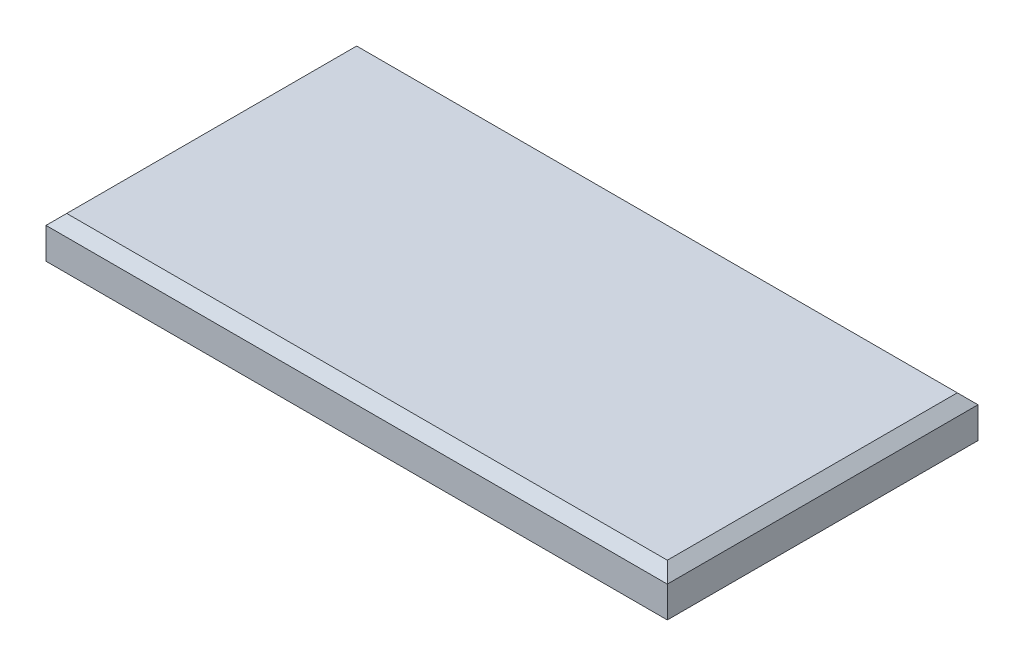
ISO-10303-21;
HEADER;
FILE_DESCRIPTION(('STEP AP214'),'2;1');
FILE_NAME('part.step','',(''),(''),'','','');
FILE_SCHEMA(('AUTOMOTIVE_DESIGN { 1 0 10303 214 1 1 1 1 }'));
ENDSEC;
DATA;
#1=APPLICATION_CONTEXT('core data for automotive mechanical design processes');
#2=APPLICATION_PROTOCOL_DEFINITION('international standard','automotive_design',2000,#1);
#3=PRODUCT_CONTEXT('',#1,'mechanical');
#4=PRODUCT('Part','Part','',(#3));
#5=PRODUCT_RELATED_PRODUCT_CATEGORY('part','',(#4));
#6=PRODUCT_DEFINITION_FORMATION('','',#4);
#7=PRODUCT_DEFINITION_CONTEXT('part definition',#1,'design');
#8=PRODUCT_DEFINITION('design','',#6,#7);
#9=PRODUCT_DEFINITION_SHAPE('','',#8);
#10=(LENGTH_UNIT() NAMED_UNIT(*) SI_UNIT(.MILLI.,.METRE.));
#11=(NAMED_UNIT(*) PLANE_ANGLE_UNIT() SI_UNIT($,.RADIAN.));
#12=(NAMED_UNIT(*) SI_UNIT($,.STERADIAN.) SOLID_ANGLE_UNIT());
#13=UNCERTAINTY_MEASURE_WITH_UNIT(LENGTH_MEASURE(1.E-05),#10,'distance_accuracy_value','');
#14=(GEOMETRIC_REPRESENTATION_CONTEXT(3) GLOBAL_UNCERTAINTY_ASSIGNED_CONTEXT((#13)) GLOBAL_UNIT_ASSIGNED_CONTEXT((#10,
#11,#12)) REPRESENTATION_CONTEXT('',''));
#15=CARTESIAN_POINT('',(0.,0.,0.));
#16=DIRECTION('',(0.,0.,1.));
#17=DIRECTION('',(1.,0.,0.));
#18=AXIS2_PLACEMENT_3D('',#15,#16,#17);
#19=CARTESIAN_POINT('',(0.,0.,0.));
#20=DIRECTION('',(0.,-1.,0.));
#21=DIRECTION('',(0.,0.,-1.));
#22=AXIS2_PLACEMENT_3D('',#19,#20,#21);
#23=PLANE('',#22);
#24=DIRECTION('',(0.,0.,-1.));
#25=VECTOR('',#24,1.);
#26=CARTESIAN_POINT('',(30.,0.,15.));
#27=LINE('',#26,#25);
#28=CARTESIAN_POINT('',(30.,0.,15.));
#29=VERTEX_POINT('',#28);
#30=CARTESIAN_POINT('',(30.,0.,-15.));
#31=VERTEX_POINT('',#30);
#32=EDGE_CURVE('E148',#29,#31,#27,.T.);
#33=ORIENTED_EDGE('',*,*,#32,.F.);
#34=DIRECTION('',(1.,0.,0.));
#35=VECTOR('',#34,1.);
#36=CARTESIAN_POINT('',(-30.,0.,15.));
#37=LINE('',#36,#35);
#38=CARTESIAN_POINT('',(-30.,0.,15.));
#39=VERTEX_POINT('',#38);
#40=EDGE_CURVE('E190',#39,#29,#37,.T.);
#41=ORIENTED_EDGE('',*,*,#40,.F.);
#42=DIRECTION('',(0.,0.,1.));
#43=VECTOR('',#42,1.);
#44=CARTESIAN_POINT('',(-30.,0.,15.));
#45=LINE('',#44,#43);
#46=CARTESIAN_POINT('',(-30.,0.,-15.));
#47=VERTEX_POINT('',#46);
#48=EDGE_CURVE('E186',#47,#39,#45,.T.);
#49=ORIENTED_EDGE('',*,*,#48,.F.);
#50=DIRECTION('',(-1.,0.,0.));
#51=VECTOR('',#50,1.);
#52=CARTESIAN_POINT('',(-30.,0.,-15.));
#53=LINE('',#52,#51);
#54=EDGE_CURVE('E154',#31,#47,#53,.T.);
#55=ORIENTED_EDGE('',*,*,#54,.F.);
#56=EDGE_LOOP('',(#33,#41,#49,#55));
#57=FACE_BOUND('',#56,.T.);
#58=DIRECTION('',(1.,0.,0.));
#59=VECTOR('',#58,1.);
#60=CARTESIAN_POINT('',(0.,0.,13.));
#61=LINE('',#60,#59);
#62=CARTESIAN_POINT('',(-28.,0.,13.));
#63=VERTEX_POINT('',#62);
#64=CARTESIAN_POINT('',(28.,0.,13.));
#65=VERTEX_POINT('',#64);
#66=EDGE_CURVE('E142',#63,#65,#61,.T.);
#67=ORIENTED_EDGE('',*,*,#66,.T.);
#68=DIRECTION('',(0.,0.,-1.));
#69=VECTOR('',#68,1.);
#70=CARTESIAN_POINT('',(28.,0.,0.));
#71=LINE('',#70,#69);
#72=CARTESIAN_POINT('',(28.,0.,-13.));
#73=VERTEX_POINT('',#72);
#74=EDGE_CURVE('E171',#65,#73,#71,.T.);
#75=ORIENTED_EDGE('',*,*,#74,.T.);
#76=DIRECTION('',(-1.,0.,0.));
#77=VECTOR('',#76,1.);
#78=CARTESIAN_POINT('',(0.,0.,-13.));
#79=LINE('',#78,#77);
#80=CARTESIAN_POINT('',(-28.,0.,-13.));
#81=VERTEX_POINT('',#80);
#82=EDGE_CURVE('E146',#73,#81,#79,.T.);
#83=ORIENTED_EDGE('',*,*,#82,.T.);
#84=DIRECTION('',(0.,0.,1.));
#85=VECTOR('',#84,1.);
#86=CARTESIAN_POINT('',(-28.,0.,0.));
#87=LINE('',#86,#85);
#88=EDGE_CURVE('E177',#81,#63,#87,.T.);
#89=ORIENTED_EDGE('',*,*,#88,.T.);
#90=EDGE_LOOP('',(#67,#75,#83,#89));
#91=FACE_BOUND('',#90,.T.);
#92=ADVANCED_FACE('F41',(#57,#91),#23,.T.);
#93=CARTESIAN_POINT('',(30.,4.,15.));
#94=DIRECTION('',(-1.,0.,0.));
#95=DIRECTION('',(0.,0.,1.));
#96=AXIS2_PLACEMENT_3D('',#93,#94,#95);
#97=PLANE('',#96);
#98=DIRECTION('',(0.,-1.,0.));
#99=VECTOR('',#98,1.);
#100=CARTESIAN_POINT('',(30.,4.,-15.));
#101=LINE('',#100,#99);
#102=CARTESIAN_POINT('',(30.,2.99999999999999,-15.));
#103=VERTEX_POINT('',#102);
#104=EDGE_CURVE('E203',#103,#31,#101,.T.);
#105=ORIENTED_EDGE('',*,*,#104,.F.);
#106=DIRECTION('',(0.,0.,1.));
#107=VECTOR('',#106,1.);
#108=CARTESIAN_POINT('',(30.,2.99999999999999,15.));
#109=LINE('',#108,#107);
#110=CARTESIAN_POINT('',(30.,2.99999999999999,15.));
#111=VERTEX_POINT('',#110);
#112=EDGE_CURVE('E11',#103,#111,#109,.T.);
#113=ORIENTED_EDGE('',*,*,#112,.T.);
#114=DIRECTION('',(0.,-1.,0.));
#115=VECTOR('',#114,1.);
#116=CARTESIAN_POINT('',(30.,4.,15.));
#117=LINE('',#116,#115);
#118=EDGE_CURVE('E194',#111,#29,#117,.T.);
#119=ORIENTED_EDGE('',*,*,#118,.T.);
#120=ORIENTED_EDGE('',*,*,#32,.T.);
#121=EDGE_LOOP('',(#105,#113,#119,#120));
#122=FACE_BOUND('',#121,.T.);
#123=ADVANCED_FACE('F287',(#122),#97,.F.);
#124=CARTESIAN_POINT('',(-30.,4.,-15.));
#125=DIRECTION('',(0.,0.,1.));
#126=DIRECTION('',(1.,0.,0.));
#127=AXIS2_PLACEMENT_3D('',#124,#125,#126);
#128=PLANE('',#127);
#129=DIRECTION('',(0.,-1.,0.));
#130=VECTOR('',#129,1.);
#131=CARTESIAN_POINT('',(-30.,4.,-15.));
#132=LINE('',#131,#130);
#133=CARTESIAN_POINT('',(-30.,2.99999999999999,-15.));
#134=VERTEX_POINT('',#133);
#135=EDGE_CURVE('E200',#134,#47,#132,.T.);
#136=ORIENTED_EDGE('',*,*,#135,.F.);
#137=DIRECTION('',(1.,0.,0.));
#138=VECTOR('',#137,1.);
#139=CARTESIAN_POINT('',(-30.,2.99999999999999,-15.));
#140=LINE('',#139,#138);
#141=EDGE_CURVE('E52',#134,#103,#140,.T.);
#142=ORIENTED_EDGE('',*,*,#141,.T.);
#143=ORIENTED_EDGE('',*,*,#104,.T.);
#144=ORIENTED_EDGE('',*,*,#54,.T.);
#145=EDGE_LOOP('',(#136,#142,#143,#144));
#146=FACE_BOUND('',#145,.T.);
#147=ADVANCED_FACE('F293',(#146),#128,.F.);
#148=CARTESIAN_POINT('',(-30.,4.,15.));
#149=DIRECTION('',(1.,0.,0.));
#150=DIRECTION('',(0.,0.,-1.));
#151=AXIS2_PLACEMENT_3D('',#148,#149,#150);
#152=PLANE('',#151);
#153=DIRECTION('',(0.,-1.,0.));
#154=VECTOR('',#153,1.);
#155=CARTESIAN_POINT('',(-30.,4.,15.));
#156=LINE('',#155,#154);
#157=CARTESIAN_POINT('',(-30.,2.99999999999999,15.));
#158=VERTEX_POINT('',#157);
#159=EDGE_CURVE('E197',#158,#39,#156,.T.);
#160=ORIENTED_EDGE('',*,*,#159,.F.);
#161=DIRECTION('',(0.,0.,-1.));
#162=VECTOR('',#161,1.);
#163=CARTESIAN_POINT('',(-30.,2.99999999999999,15.));
#164=LINE('',#163,#162);
#165=EDGE_CURVE('E67',#158,#134,#164,.T.);
#166=ORIENTED_EDGE('',*,*,#165,.T.);
#167=ORIENTED_EDGE('',*,*,#135,.T.);
#168=ORIENTED_EDGE('',*,*,#48,.T.);
#169=EDGE_LOOP('',(#160,#166,#167,#168));
#170=FACE_BOUND('',#169,.T.);
#171=ADVANCED_FACE('F303',(#170),#152,.F.);
#172=CARTESIAN_POINT('',(-30.,4.,15.));
#173=DIRECTION('',(0.,0.,-1.));
#174=DIRECTION('',(-1.,0.,0.));
#175=AXIS2_PLACEMENT_3D('',#172,#173,#174);
#176=PLANE('',#175);
#177=ORIENTED_EDGE('',*,*,#118,.F.);
#178=DIRECTION('',(-1.,0.,0.));
#179=VECTOR('',#178,1.);
#180=CARTESIAN_POINT('',(-30.,2.99999999999999,15.));
#181=LINE('',#180,#179);
#182=EDGE_CURVE('E235',#111,#158,#181,.T.);
#183=ORIENTED_EDGE('',*,*,#182,.T.);
#184=ORIENTED_EDGE('',*,*,#159,.T.);
#185=ORIENTED_EDGE('',*,*,#40,.T.);
#186=EDGE_LOOP('',(#177,#183,#184,#185));
#187=FACE_BOUND('',#186,.T.);
#188=ADVANCED_FACE('F300',(#187),#176,.F.);
#189=CARTESIAN_POINT('',(0.,4.,0.));
#190=DIRECTION('',(0.,-1.,0.));
#191=DIRECTION('',(0.,0.,-1.));
#192=AXIS2_PLACEMENT_3D('',#189,#190,#191);
#193=PLANE('',#192);
#194=DIRECTION('',(0.,0.,1.));
#195=VECTOR('',#194,1.);
#196=CARTESIAN_POINT('',(-29.,4.,0.));
#197=LINE('',#196,#195);
#198=CARTESIAN_POINT('',(-29.,4.,-14.));
#199=VERTEX_POINT('',#198);
#200=CARTESIAN_POINT('',(-29.,4.,14.));
#201=VERTEX_POINT('',#200);
#202=EDGE_CURVE('E228',#199,#201,#197,.T.);
#203=ORIENTED_EDGE('',*,*,#202,.T.);
#204=DIRECTION('',(1.,0.,0.));
#205=VECTOR('',#204,1.);
#206=CARTESIAN_POINT('',(0.,4.,14.));
#207=LINE('',#206,#205);
#208=CARTESIAN_POINT('',(29.,4.,14.));
#209=VERTEX_POINT('',#208);
#210=EDGE_CURVE('E231',#201,#209,#207,.T.);
#211=ORIENTED_EDGE('',*,*,#210,.T.);
#212=DIRECTION('',(0.,0.,-1.));
#213=VECTOR('',#212,1.);
#214=CARTESIAN_POINT('',(29.,4.,0.));
#215=LINE('',#214,#213);
#216=CARTESIAN_POINT('',(29.,4.,-14.));
#217=VERTEX_POINT('',#216);
#218=EDGE_CURVE('E222',#209,#217,#215,.T.);
#219=ORIENTED_EDGE('',*,*,#218,.T.);
#220=DIRECTION('',(-1.,0.,0.));
#221=VECTOR('',#220,1.);
#222=CARTESIAN_POINT('',(0.,4.,-14.));
#223=LINE('',#222,#221);
#224=EDGE_CURVE('E225',#217,#199,#223,.T.);
#225=ORIENTED_EDGE('',*,*,#224,.T.);
#226=EDGE_LOOP('',(#203,#211,#219,#225));
#227=FACE_BOUND('',#226,.T.);
#228=ADVANCED_FACE('F299',(#227),#193,.F.);
#229=CARTESIAN_POINT('',(28.,4.,15.));
#230=DIRECTION('',(-1.,0.,0.));
#231=DIRECTION('',(0.,0.,1.));
#232=AXIS2_PLACEMENT_3D('',#229,#230,#231);
#233=PLANE('',#232);
#234=ORIENTED_EDGE('',*,*,#74,.F.);
#235=DIRECTION('',(0.,-1.,0.));
#236=VECTOR('',#235,1.);
#237=CARTESIAN_POINT('',(28.,4.,13.));
#238=LINE('',#237,#236);
#239=CARTESIAN_POINT('',(28.,2.,13.));
#240=VERTEX_POINT('',#239);
#241=EDGE_CURVE('E140',#240,#65,#238,.T.);
#242=ORIENTED_EDGE('',*,*,#241,.F.);
#243=DIRECTION('',(0.,0.,-1.));
#244=VECTOR('',#243,1.);
#245=CARTESIAN_POINT('',(28.,2.,0.));
#246=LINE('',#245,#244);
#247=CARTESIAN_POINT('',(28.,2.,-13.));
#248=VERTEX_POINT('',#247);
#249=EDGE_CURVE('E125',#240,#248,#246,.T.);
#250=ORIENTED_EDGE('',*,*,#249,.T.);
#251=DIRECTION('',(0.,-1.,0.));
#252=VECTOR('',#251,1.);
#253=CARTESIAN_POINT('',(28.,4.,-13.));
#254=LINE('',#253,#252);
#255=EDGE_CURVE('E138',#248,#73,#254,.T.);
#256=ORIENTED_EDGE('',*,*,#255,.T.);
#257=EDGE_LOOP('',(#234,#242,#250,#256));
#258=FACE_BOUND('',#257,.T.);
#259=ADVANCED_FACE('F137',(#258),#233,.T.);
#260=CARTESIAN_POINT('',(-30.,4.,-13.));
#261=DIRECTION('',(0.,0.,1.));
#262=DIRECTION('',(1.,0.,0.));
#263=AXIS2_PLACEMENT_3D('',#260,#261,#262);
#264=PLANE('',#263);
#265=ORIENTED_EDGE('',*,*,#82,.F.);
#266=ORIENTED_EDGE('',*,*,#255,.F.);
#267=DIRECTION('',(-1.,0.,0.));
#268=VECTOR('',#267,1.);
#269=CARTESIAN_POINT('',(0.,2.,-13.));
#270=LINE('',#269,#268);
#271=CARTESIAN_POINT('',(-28.,2.,-13.));
#272=VERTEX_POINT('',#271);
#273=EDGE_CURVE('E121',#248,#272,#270,.T.);
#274=ORIENTED_EDGE('',*,*,#273,.T.);
#275=DIRECTION('',(0.,-1.,0.));
#276=VECTOR('',#275,1.);
#277=CARTESIAN_POINT('',(-28.,4.,-13.));
#278=LINE('',#277,#276);
#279=EDGE_CURVE('E149',#272,#81,#278,.T.);
#280=ORIENTED_EDGE('',*,*,#279,.T.);
#281=EDGE_LOOP('',(#265,#266,#274,#280));
#282=FACE_BOUND('',#281,.T.);
#283=ADVANCED_FACE('F144',(#282),#264,.T.);
#284=CARTESIAN_POINT('',(-28.,4.,15.));
#285=DIRECTION('',(1.,0.,0.));
#286=DIRECTION('',(0.,0.,-1.));
#287=AXIS2_PLACEMENT_3D('',#284,#285,#286);
#288=PLANE('',#287);
#289=ORIENTED_EDGE('',*,*,#88,.F.);
#290=ORIENTED_EDGE('',*,*,#279,.F.);
#291=DIRECTION('',(0.,0.,1.));
#292=VECTOR('',#291,1.);
#293=CARTESIAN_POINT('',(-28.,2.,0.));
#294=LINE('',#293,#292);
#295=CARTESIAN_POINT('',(-28.,2.,13.));
#296=VERTEX_POINT('',#295);
#297=EDGE_CURVE('E126',#272,#296,#294,.T.);
#298=ORIENTED_EDGE('',*,*,#297,.T.);
#299=DIRECTION('',(0.,-1.,0.));
#300=VECTOR('',#299,1.);
#301=CARTESIAN_POINT('',(-28.,4.,13.));
#302=LINE('',#301,#300);
#303=EDGE_CURVE('E156',#296,#63,#302,.T.);
#304=ORIENTED_EDGE('',*,*,#303,.T.);
#305=EDGE_LOOP('',(#289,#290,#298,#304));
#306=FACE_BOUND('',#305,.T.);
#307=ADVANCED_FACE('F282',(#306),#288,.T.);
#308=CARTESIAN_POINT('',(-30.,4.,13.));
#309=DIRECTION('',(0.,0.,-1.));
#310=DIRECTION('',(-1.,0.,0.));
#311=AXIS2_PLACEMENT_3D('',#308,#309,#310);
#312=PLANE('',#311);
#313=ORIENTED_EDGE('',*,*,#66,.F.);
#314=ORIENTED_EDGE('',*,*,#303,.F.);
#315=DIRECTION('',(1.,0.,0.));
#316=VECTOR('',#315,1.);
#317=CARTESIAN_POINT('',(0.,2.,13.));
#318=LINE('',#317,#316);
#319=EDGE_CURVE('E163',#296,#240,#318,.T.);
#320=ORIENTED_EDGE('',*,*,#319,.T.);
#321=ORIENTED_EDGE('',*,*,#241,.T.);
#322=EDGE_LOOP('',(#313,#314,#320,#321));
#323=FACE_BOUND('',#322,.T.);
#324=ADVANCED_FACE('F272',(#323),#312,.T.);
#325=CARTESIAN_POINT('',(0.,2.,0.));
#326=DIRECTION('',(0.,-1.,0.));
#327=DIRECTION('',(0.,0.,-1.));
#328=AXIS2_PLACEMENT_3D('',#325,#326,#327);
#329=PLANE('',#328);
#330=CARTESIAN_POINT('',(15.,2.,0.));
#331=DIRECTION('',(0.,-1.,0.));
#332=DIRECTION('',(0.,0.,1.));
#333=AXIS2_PLACEMENT_3D('',#330,#331,#332);
#334=CIRCLE('',#333,2.);
#335=CARTESIAN_POINT('',(15.,2.,2.));
#336=VERTEX_POINT('',#335);
#337=EDGE_CURVE('E257',#336,#336,#334,.T.);
#338=ORIENTED_EDGE('',*,*,#337,.F.);
#339=EDGE_LOOP('',(#338));
#340=FACE_BOUND('',#339,.T.);
#341=CARTESIAN_POINT('',(-15.,2.,0.));
#342=DIRECTION('',(0.,-1.,0.));
#343=DIRECTION('',(0.,0.,-1.));
#344=AXIS2_PLACEMENT_3D('',#341,#342,#343);
#345=CIRCLE('',#344,2.);
#346=CARTESIAN_POINT('',(-15.,2.,-2.));
#347=VERTEX_POINT('',#346);
#348=EDGE_CURVE('E159',#347,#347,#345,.T.);
#349=ORIENTED_EDGE('',*,*,#348,.F.);
#350=EDGE_LOOP('',(#349));
#351=FACE_BOUND('',#350,.T.);
#352=ORIENTED_EDGE('',*,*,#249,.F.);
#353=ORIENTED_EDGE('',*,*,#319,.F.);
#354=ORIENTED_EDGE('',*,*,#297,.F.);
#355=ORIENTED_EDGE('',*,*,#273,.F.);
#356=EDGE_LOOP('',(#352,#353,#354,#355));
#357=FACE_BOUND('',#356,.T.);
#358=ADVANCED_FACE('F123',(#340,#351,#357),#329,.T.);
#359=CARTESIAN_POINT('',(-15.,-8.,0.));
#360=DIRECTION('',(0.,1.,0.));
#361=DIRECTION('',(0.,0.,1.));
#362=AXIS2_PLACEMENT_3D('',#359,#360,#361);
#363=CYLINDRICAL_SURFACE('',#362,2.);
#364=CARTESIAN_POINT('',(-15.,-7.,0.));
#365=DIRECTION('',(0.,-1.,0.));
#366=DIRECTION('',(0.,0.,-1.));
#367=AXIS2_PLACEMENT_3D('',#364,#365,#366);
#368=CIRCLE('',#367,2.);
#369=CARTESIAN_POINT('',(-15.,-7.,-2.));
#370=VERTEX_POINT('',#369);
#371=EDGE_CURVE('E218',#370,#370,#368,.F.);
#372=ORIENTED_EDGE('',*,*,#371,.T.);
#373=EDGE_LOOP('',(#372));
#374=FACE_BOUND('',#373,.T.);
#375=ORIENTED_EDGE('',*,*,#348,.T.);
#376=EDGE_LOOP('',(#375));
#377=FACE_BOUND('',#376,.T.);
#378=ADVANCED_FACE('F269',(#374,#377),#363,.T.);
#379=CARTESIAN_POINT('',(-15.,-8.,0.));
#380=DIRECTION('',(0.,-1.,0.));
#381=DIRECTION('',(0.,0.,-1.));
#382=AXIS2_PLACEMENT_3D('',#379,#380,#381);
#383=PLANE('',#382);
#384=CARTESIAN_POINT('',(-15.,-8.,0.));
#385=DIRECTION('',(0.,-1.,0.));
#386=DIRECTION('',(0.,0.,-1.));
#387=AXIS2_PLACEMENT_3D('',#384,#385,#386);
#388=CIRCLE('',#387,1.);
#389=CARTESIAN_POINT('',(-15.,-8.,-1.));
#390=VERTEX_POINT('',#389);
#391=EDGE_CURVE('E214',#390,#390,#388,.T.);
#392=ORIENTED_EDGE('',*,*,#391,.T.);
#393=EDGE_LOOP('',(#392));
#394=FACE_BOUND('',#393,.T.);
#395=ADVANCED_FACE('F279',(#394),#383,.T.);
#396=CARTESIAN_POINT('',(15.,-8.,0.));
#397=DIRECTION('',(0.,1.,0.));
#398=DIRECTION('',(0.,0.,1.));
#399=AXIS2_PLACEMENT_3D('',#396,#397,#398);
#400=CYLINDRICAL_SURFACE('',#399,2.);
#401=CARTESIAN_POINT('',(15.,-7.,0.));
#402=DIRECTION('',(0.,1.,0.));
#403=DIRECTION('',(0.,0.,1.));
#404=AXIS2_PLACEMENT_3D('',#401,#402,#403);
#405=CIRCLE('',#404,2.);
#406=CARTESIAN_POINT('',(15.,-7.,2.));
#407=VERTEX_POINT('',#406);
#408=EDGE_CURVE('E210',#407,#407,#405,.T.);
#409=ORIENTED_EDGE('',*,*,#408,.T.);
#410=EDGE_LOOP('',(#409));
#411=FACE_BOUND('',#410,.T.);
#412=ORIENTED_EDGE('',*,*,#337,.T.);
#413=EDGE_LOOP('',(#412));
#414=FACE_BOUND('',#413,.T.);
#415=ADVANCED_FACE('F391',(#411,#414),#400,.T.);
#416=CARTESIAN_POINT('',(15.,-8.,0.));
#417=DIRECTION('',(0.,1.,0.));
#418=DIRECTION('',(0.,0.,1.));
#419=AXIS2_PLACEMENT_3D('',#416,#417,#418);
#420=PLANE('',#419);
#421=CARTESIAN_POINT('',(15.,-8.,0.));
#422=DIRECTION('',(0.,1.,0.));
#423=DIRECTION('',(0.,0.,1.));
#424=AXIS2_PLACEMENT_3D('',#421,#422,#423);
#425=CIRCLE('',#424,1.);
#426=CARTESIAN_POINT('',(15.,-8.,1.));
#427=VERTEX_POINT('',#426);
#428=EDGE_CURVE('E206',#427,#427,#425,.F.);
#429=ORIENTED_EDGE('',*,*,#428,.T.);
#430=EDGE_LOOP('',(#429));
#431=FACE_BOUND('',#430,.T.);
#432=ADVANCED_FACE('F313',(#431),#420,.F.);
#433=CARTESIAN_POINT('',(15.,-7.,0.));
#434=DIRECTION('',(0.,1.,0.));
#435=DIRECTION('',(0.,0.,1.));
#436=AXIS2_PLACEMENT_3D('',#433,#434,#435);
#437=TOROIDAL_SURFACE('',#436,1.,1.);
#438=ORIENTED_EDGE('',*,*,#408,.F.);
#439=EDGE_LOOP('',(#438));
#440=FACE_BOUND('',#439,.T.);
#441=ORIENTED_EDGE('',*,*,#428,.F.);
#442=EDGE_LOOP('',(#441));
#443=FACE_BOUND('',#442,.T.);
#444=ADVANCED_FACE('F309',(#440,#443),#437,.T.);
#445=CARTESIAN_POINT('',(-15.,-7.,0.));
#446=DIRECTION('',(0.,-1.,0.));
#447=DIRECTION('',(0.,0.,-1.));
#448=AXIS2_PLACEMENT_3D('',#445,#446,#447);
#449=TOROIDAL_SURFACE('',#448,1.,1.);
#450=ORIENTED_EDGE('',*,*,#371,.F.);
#451=EDGE_LOOP('',(#450));
#452=FACE_BOUND('',#451,.T.);
#453=ORIENTED_EDGE('',*,*,#391,.F.);
#454=EDGE_LOOP('',(#453));
#455=FACE_BOUND('',#454,.T.);
#456=ADVANCED_FACE('F312',(#452,#455),#449,.T.);
#457=CARTESIAN_POINT('',(0.,4.,-14.));
#458=DIRECTION('',(0.,-0.707106781186547,0.707106781186547));
#459=DIRECTION('',(-1.,0.,0.));
#460=AXIS2_PLACEMENT_3D('',#457,#458,#459);
#461=PLANE('',#460);
#462=DIRECTION('',(-0.577350269189626,0.577350269189626,0.577350269189626));
#463=VECTOR('',#462,1.);
#464=CARTESIAN_POINT('',(24.3333333333333,8.66666666666666,-9.33333333333333));
#465=LINE('',#464,#463);
#466=EDGE_CURVE('E248',#103,#217,#465,.T.);
#467=ORIENTED_EDGE('',*,*,#466,.F.);
#468=ORIENTED_EDGE('',*,*,#141,.F.);
#469=DIRECTION('',(0.577350269189626,0.577350269189626,0.577350269189626));
#470=VECTOR('',#469,1.);
#471=CARTESIAN_POINT('',(-19.3333333333333,13.6666666666667,-4.33333333333332));
#472=LINE('',#471,#470);
#473=EDGE_CURVE('E46',#199,#134,#472,.F.);
#474=ORIENTED_EDGE('',*,*,#473,.F.);
#475=ORIENTED_EDGE('',*,*,#224,.F.);
#476=EDGE_LOOP('',(#467,#468,#474,#475));
#477=FACE_BOUND('',#476,.T.);
#478=ADVANCED_FACE('F44',(#477),#461,.F.);
#479=CARTESIAN_POINT('',(-29.,4.,0.));
#480=DIRECTION('',(0.707106781186547,-0.707106781186547,0.));
#481=DIRECTION('',(0.,0.,1.));
#482=AXIS2_PLACEMENT_3D('',#479,#480,#481);
#483=PLANE('',#482);
#484=ORIENTED_EDGE('',*,*,#473,.T.);
#485=ORIENTED_EDGE('',*,*,#165,.F.);
#486=DIRECTION('',(0.577350269189626,0.577350269189626,-0.577350269189626));
#487=VECTOR('',#486,1.);
#488=CARTESIAN_POINT('',(-24.3333333333333,8.66666666666666,9.33333333333333));
#489=LINE('',#488,#487);
#490=EDGE_CURVE('E246',#201,#158,#489,.F.);
#491=ORIENTED_EDGE('',*,*,#490,.F.);
#492=ORIENTED_EDGE('',*,*,#202,.F.);
#493=EDGE_LOOP('',(#484,#485,#491,#492));
#494=FACE_BOUND('',#493,.T.);
#495=ADVANCED_FACE('F331',(#494),#483,.F.);
#496=CARTESIAN_POINT('',(29.,4.,0.));
#497=DIRECTION('',(-0.707106781186547,-0.707106781186547,0.));
#498=DIRECTION('',(0.,0.,-1.));
#499=AXIS2_PLACEMENT_3D('',#496,#497,#498);
#500=PLANE('',#499);
#501=ORIENTED_EDGE('',*,*,#466,.T.);
#502=ORIENTED_EDGE('',*,*,#218,.F.);
#503=DIRECTION('',(0.577350269189626,-0.577350269189626,0.577350269189626));
#504=VECTOR('',#503,1.);
#505=CARTESIAN_POINT('',(24.3333333333333,8.66666666666666,9.33333333333333));
#506=LINE('',#505,#504);
#507=EDGE_CURVE('E243',#111,#209,#506,.F.);
#508=ORIENTED_EDGE('',*,*,#507,.F.);
#509=ORIENTED_EDGE('',*,*,#112,.F.);
#510=EDGE_LOOP('',(#501,#502,#508,#509));
#511=FACE_BOUND('',#510,.T.);
#512=ADVANCED_FACE('F325',(#511),#500,.F.);
#513=CARTESIAN_POINT('',(0.,4.,14.));
#514=DIRECTION('',(0.,-0.707106781186547,-0.707106781186547));
#515=DIRECTION('',(1.,0.,0.));
#516=AXIS2_PLACEMENT_3D('',#513,#514,#515);
#517=PLANE('',#516);
#518=ORIENTED_EDGE('',*,*,#490,.T.);
#519=ORIENTED_EDGE('',*,*,#182,.F.);
#520=ORIENTED_EDGE('',*,*,#507,.T.);
#521=ORIENTED_EDGE('',*,*,#210,.F.);
#522=EDGE_LOOP('',(#518,#519,#520,#521));
#523=FACE_BOUND('',#522,.T.);
#524=ADVANCED_FACE('F319',(#523),#517,.F.);
#525=CLOSED_SHELL('',(#92,#123,#147,#171,#188,#228,#259,#283,#307,#324,#358,#378,#395,#415,#432,
#444,#456,#478,#495,#512,#524));
#526=MANIFOLD_SOLID_BREP('B2',#525);
#527=ADVANCED_BREP_SHAPE_REPRESENTATION('',(#18,#526),#14);
#528=SHAPE_DEFINITION_REPRESENTATION(#9,#527);
ENDSEC;
END-ISO-10303-21;
